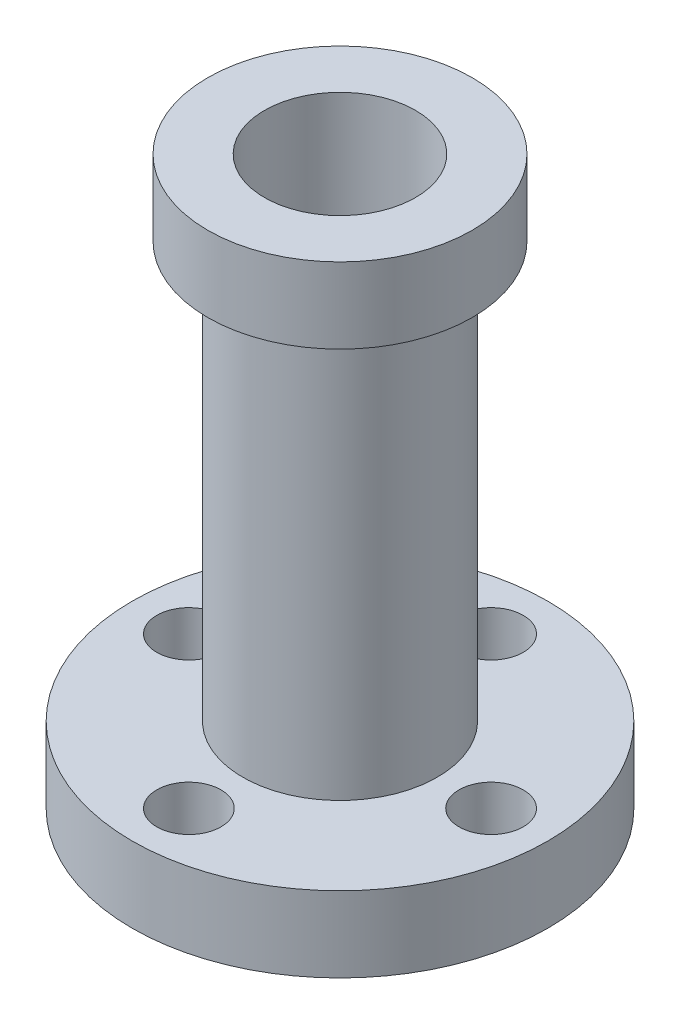
ISO-10303-21;
HEADER;
FILE_DESCRIPTION(('STEP AP214'),'2;1');
FILE_NAME('part.step','',(''),(''),'','','');
FILE_SCHEMA(('AUTOMOTIVE_DESIGN { 1 0 10303 214 1 1 1 1 }'));
ENDSEC;
DATA;
#1=APPLICATION_CONTEXT('core data for automotive mechanical design processes');
#2=APPLICATION_PROTOCOL_DEFINITION('international standard','automotive_design',2000,#1);
#3=PRODUCT_CONTEXT('',#1,'mechanical');
#4=PRODUCT('Part','Part','',(#3));
#5=PRODUCT_RELATED_PRODUCT_CATEGORY('part','',(#4));
#6=PRODUCT_DEFINITION_FORMATION('','',#4);
#7=PRODUCT_DEFINITION_CONTEXT('part definition',#1,'design');
#8=PRODUCT_DEFINITION('design','',#6,#7);
#9=PRODUCT_DEFINITION_SHAPE('','',#8);
#10=(LENGTH_UNIT() NAMED_UNIT(*) SI_UNIT(.MILLI.,.METRE.));
#11=(NAMED_UNIT(*) PLANE_ANGLE_UNIT() SI_UNIT($,.RADIAN.));
#12=(NAMED_UNIT(*) SI_UNIT($,.STERADIAN.) SOLID_ANGLE_UNIT());
#13=UNCERTAINTY_MEASURE_WITH_UNIT(LENGTH_MEASURE(1.E-05),#10,'distance_accuracy_value','');
#14=(GEOMETRIC_REPRESENTATION_CONTEXT(3) GLOBAL_UNCERTAINTY_ASSIGNED_CONTEXT((#13)) GLOBAL_UNIT_ASSIGNED_CONTEXT((#10,
#11,#12)) REPRESENTATION_CONTEXT('',''));
#15=CARTESIAN_POINT('',(0.,0.,0.));
#16=DIRECTION('',(0.,0.,1.));
#17=DIRECTION('',(1.,0.,0.));
#18=AXIS2_PLACEMENT_3D('',#15,#16,#17);
#19=CARTESIAN_POINT('',(0.,0.,0.));
#20=DIRECTION('',(0.,-1.,0.));
#21=DIRECTION('',(0.,0.,-1.));
#22=AXIS2_PLACEMENT_3D('',#19,#20,#21);
#23=CYLINDRICAL_SURFACE('',#22,5.15);
#24=CARTESIAN_POINT('',(0.,26.,0.));
#25=DIRECTION('',(0.,-1.,0.));
#26=DIRECTION('',(0.,0.,-1.));
#27=AXIS2_PLACEMENT_3D('',#24,#25,#26);
#28=CIRCLE('',#27,5.15);
#29=CARTESIAN_POINT('',(0.,26.,-5.15));
#30=VERTEX_POINT('',#29);
#31=EDGE_CURVE('E78',#30,#30,#28,.F.);
#32=ORIENTED_EDGE('',*,*,#31,.F.);
#33=EDGE_LOOP('',(#32));
#34=FACE_BOUND('',#33,.T.);
#35=CARTESIAN_POINT('',(0.,4.,0.));
#36=DIRECTION('',(0.,-1.,0.));
#37=DIRECTION('',(0.,0.,-1.));
#38=AXIS2_PLACEMENT_3D('',#35,#36,#37);
#39=CIRCLE('',#38,5.15);
#40=CARTESIAN_POINT('',(0.,4.,-5.15));
#41=VERTEX_POINT('',#40);
#42=EDGE_CURVE('E17',#41,#41,#39,.T.);
#43=ORIENTED_EDGE('',*,*,#42,.F.);
#44=EDGE_LOOP('',(#43));
#45=FACE_BOUND('',#44,.T.);
#46=ADVANCED_FACE('F14',(#34,#45),#23,.T.);
#47=CARTESIAN_POINT('',(11.,4.,0.));
#48=DIRECTION('',(0.,1.,0.));
#49=DIRECTION('',(0.,0.,1.));
#50=AXIS2_PLACEMENT_3D('',#47,#48,#49);
#51=PLANE('',#50);
#52=CARTESIAN_POINT('',(0.,4.,8.));
#53=DIRECTION('',(0.,-1.,0.));
#54=DIRECTION('',(0.,0.,-1.));
#55=AXIS2_PLACEMENT_3D('',#52,#53,#54);
#56=CIRCLE('',#55,1.69999999999999);
#57=CARTESIAN_POINT('',(0.,4.,6.30000000000001));
#58=VERTEX_POINT('',#57);
#59=EDGE_CURVE('E76',#58,#58,#56,.T.);
#60=ORIENTED_EDGE('',*,*,#59,.T.);
#61=EDGE_LOOP('',(#60));
#62=FACE_BOUND('',#61,.T.);
#63=CARTESIAN_POINT('',(0.,4.,-8.));
#64=DIRECTION('',(0.,-1.,0.));
#65=DIRECTION('',(0.,0.,-1.));
#66=AXIS2_PLACEMENT_3D('',#63,#64,#65);
#67=CIRCLE('',#66,1.69999999999999);
#68=CARTESIAN_POINT('',(0.,4.,-9.69999999999999));
#69=VERTEX_POINT('',#68);
#70=EDGE_CURVE('E68',#69,#69,#67,.T.);
#71=ORIENTED_EDGE('',*,*,#70,.T.);
#72=EDGE_LOOP('',(#71));
#73=FACE_BOUND('',#72,.T.);
#74=CARTESIAN_POINT('',(0.,4.,0.));
#75=DIRECTION('',(0.,-1.,0.));
#76=DIRECTION('',(0.,0.,-1.));
#77=AXIS2_PLACEMENT_3D('',#74,#75,#76);
#78=CIRCLE('',#77,11.);
#79=CARTESIAN_POINT('',(0.,4.,-11.));
#80=VERTEX_POINT('',#79);
#81=EDGE_CURVE('E60',#80,#80,#78,.T.);
#82=ORIENTED_EDGE('',*,*,#81,.F.);
#83=EDGE_LOOP('',(#82));
#84=FACE_BOUND('',#83,.T.);
#85=ORIENTED_EDGE('',*,*,#42,.T.);
#86=EDGE_LOOP('',(#85));
#87=FACE_BOUND('',#86,.T.);
#88=CARTESIAN_POINT('',(-8.,4.,0.));
#89=DIRECTION('',(0.,-1.,0.));
#90=DIRECTION('',(0.,0.,-1.));
#91=AXIS2_PLACEMENT_3D('',#88,#89,#90);
#92=CIRCLE('',#91,1.69999999999999);
#93=CARTESIAN_POINT('',(-8.,4.,-1.69999999999999));
#94=VERTEX_POINT('',#93);
#95=EDGE_CURVE('E64',#94,#94,#92,.T.);
#96=ORIENTED_EDGE('',*,*,#95,.T.);
#97=EDGE_LOOP('',(#96));
#98=FACE_BOUND('',#97,.T.);
#99=CARTESIAN_POINT('',(8.,4.,0.));
#100=DIRECTION('',(0.,-1.,0.));
#101=DIRECTION('',(0.,0.,-1.));
#102=AXIS2_PLACEMENT_3D('',#99,#100,#101);
#103=CIRCLE('',#102,1.69999999999999);
#104=CARTESIAN_POINT('',(8.,4.,-1.69999999999999));
#105=VERTEX_POINT('',#104);
#106=EDGE_CURVE('E72',#105,#105,#103,.T.);
#107=ORIENTED_EDGE('',*,*,#106,.T.);
#108=EDGE_LOOP('',(#107));
#109=FACE_BOUND('',#108,.T.);
#110=ADVANCED_FACE('F87',(#62,#73,#84,#87,#98,#109),#51,.T.);
#111=CARTESIAN_POINT('',(5.15,26.,0.));
#112=DIRECTION('',(0.,-1.,0.));
#113=DIRECTION('',(0.,0.,-1.));
#114=AXIS2_PLACEMENT_3D('',#111,#112,#113);
#115=PLANE('',#114);
#116=ORIENTED_EDGE('',*,*,#31,.T.);
#117=EDGE_LOOP('',(#116));
#118=FACE_BOUND('',#117,.T.);
#119=CARTESIAN_POINT('',(0.,26.,0.));
#120=DIRECTION('',(0.,-1.,0.));
#121=DIRECTION('',(0.,0.,-1.));
#122=AXIS2_PLACEMENT_3D('',#119,#120,#121);
#123=CIRCLE('',#122,7.);
#124=CARTESIAN_POINT('',(0.,26.,-7.));
#125=VERTEX_POINT('',#124);
#126=EDGE_CURVE('E56',#125,#125,#123,.F.);
#127=ORIENTED_EDGE('',*,*,#126,.F.);
#128=EDGE_LOOP('',(#127));
#129=FACE_BOUND('',#128,.T.);
#130=ADVANCED_FACE('F97',(#118,#129),#115,.T.);
#131=CARTESIAN_POINT('',(0.,0.,8.));
#132=DIRECTION('',(0.,-1.,0.));
#133=DIRECTION('',(0.,0.,-1.));
#134=AXIS2_PLACEMENT_3D('',#131,#132,#133);
#135=CYLINDRICAL_SURFACE('',#134,1.69999999999999);
#136=CARTESIAN_POINT('',(0.,0.,8.));
#137=DIRECTION('',(0.,-1.,0.));
#138=DIRECTION('',(0.,0.,-1.));
#139=AXIS2_PLACEMENT_3D('',#136,#137,#138);
#140=CIRCLE('',#139,1.69999999999999);
#141=CARTESIAN_POINT('',(0.,0.,6.30000000000001));
#142=VERTEX_POINT('',#141);
#143=EDGE_CURVE('E52',#142,#142,#140,.F.);
#144=ORIENTED_EDGE('',*,*,#143,.F.);
#145=EDGE_LOOP('',(#144));
#146=FACE_BOUND('',#145,.T.);
#147=ORIENTED_EDGE('',*,*,#59,.F.);
#148=EDGE_LOOP('',(#147));
#149=FACE_BOUND('',#148,.T.);
#150=ADVANCED_FACE('F132',(#146,#149),#135,.F.);
#151=CARTESIAN_POINT('',(8.,0.,0.));
#152=DIRECTION('',(0.,-1.,0.));
#153=DIRECTION('',(0.,0.,-1.));
#154=AXIS2_PLACEMENT_3D('',#151,#152,#153);
#155=CYLINDRICAL_SURFACE('',#154,1.69999999999999);
#156=CARTESIAN_POINT('',(8.,0.,0.));
#157=DIRECTION('',(0.,-1.,0.));
#158=DIRECTION('',(0.,0.,-1.));
#159=AXIS2_PLACEMENT_3D('',#156,#157,#158);
#160=CIRCLE('',#159,1.69999999999999);
#161=CARTESIAN_POINT('',(8.,0.,-1.69999999999999));
#162=VERTEX_POINT('',#161);
#163=EDGE_CURVE('E48',#162,#162,#160,.F.);
#164=ORIENTED_EDGE('',*,*,#163,.F.);
#165=EDGE_LOOP('',(#164));
#166=FACE_BOUND('',#165,.T.);
#167=ORIENTED_EDGE('',*,*,#106,.F.);
#168=EDGE_LOOP('',(#167));
#169=FACE_BOUND('',#168,.T.);
#170=ADVANCED_FACE('F128',(#166,#169),#155,.F.);
#171=CARTESIAN_POINT('',(0.,0.,-8.));
#172=DIRECTION('',(0.,-1.,0.));
#173=DIRECTION('',(0.,0.,-1.));
#174=AXIS2_PLACEMENT_3D('',#171,#172,#173);
#175=CYLINDRICAL_SURFACE('',#174,1.69999999999999);
#176=CARTESIAN_POINT('',(0.,0.,-8.));
#177=DIRECTION('',(0.,-1.,0.));
#178=DIRECTION('',(0.,0.,-1.));
#179=AXIS2_PLACEMENT_3D('',#176,#177,#178);
#180=CIRCLE('',#179,1.69999999999999);
#181=CARTESIAN_POINT('',(0.,0.,-9.69999999999999));
#182=VERTEX_POINT('',#181);
#183=EDGE_CURVE('E44',#182,#182,#180,.F.);
#184=ORIENTED_EDGE('',*,*,#183,.F.);
#185=EDGE_LOOP('',(#184));
#186=FACE_BOUND('',#185,.T.);
#187=ORIENTED_EDGE('',*,*,#70,.F.);
#188=EDGE_LOOP('',(#187));
#189=FACE_BOUND('',#188,.T.);
#190=ADVANCED_FACE('F124',(#186,#189),#175,.F.);
#191=CARTESIAN_POINT('',(-8.,0.,0.));
#192=DIRECTION('',(0.,-1.,0.));
#193=DIRECTION('',(0.,0.,-1.));
#194=AXIS2_PLACEMENT_3D('',#191,#192,#193);
#195=CYLINDRICAL_SURFACE('',#194,1.69999999999999);
#196=CARTESIAN_POINT('',(-8.,0.,0.));
#197=DIRECTION('',(0.,-1.,0.));
#198=DIRECTION('',(0.,0.,-1.));
#199=AXIS2_PLACEMENT_3D('',#196,#197,#198);
#200=CIRCLE('',#199,1.69999999999999);
#201=CARTESIAN_POINT('',(-8.,0.,-1.69999999999999));
#202=VERTEX_POINT('',#201);
#203=EDGE_CURVE('E40',#202,#202,#200,.F.);
#204=ORIENTED_EDGE('',*,*,#203,.F.);
#205=EDGE_LOOP('',(#204));
#206=FACE_BOUND('',#205,.T.);
#207=ORIENTED_EDGE('',*,*,#95,.F.);
#208=EDGE_LOOP('',(#207));
#209=FACE_BOUND('',#208,.T.);
#210=ADVANCED_FACE('F121',(#206,#209),#195,.F.);
#211=CARTESIAN_POINT('',(0.,0.,0.));
#212=DIRECTION('',(0.,-1.,0.));
#213=DIRECTION('',(0.,0.,-1.));
#214=AXIS2_PLACEMENT_3D('',#211,#212,#213);
#215=CYLINDRICAL_SURFACE('',#214,11.);
#216=ORIENTED_EDGE('',*,*,#81,.T.);
#217=EDGE_LOOP('',(#216));
#218=FACE_BOUND('',#217,.T.);
#219=CARTESIAN_POINT('',(0.,0.,0.));
#220=DIRECTION('',(0.,-1.,0.));
#221=DIRECTION('',(0.,0.,-1.));
#222=AXIS2_PLACEMENT_3D('',#219,#220,#221);
#223=CIRCLE('',#222,11.);
#224=CARTESIAN_POINT('',(0.,0.,-11.));
#225=VERTEX_POINT('',#224);
#226=EDGE_CURVE('E36',#225,#225,#223,.T.);
#227=ORIENTED_EDGE('',*,*,#226,.F.);
#228=EDGE_LOOP('',(#227));
#229=FACE_BOUND('',#228,.T.);
#230=ADVANCED_FACE('F117',(#218,#229),#215,.T.);
#231=CARTESIAN_POINT('',(0.,0.,0.));
#232=DIRECTION('',(0.,-1.,0.));
#233=DIRECTION('',(0.,0.,-1.));
#234=AXIS2_PLACEMENT_3D('',#231,#232,#233);
#235=CYLINDRICAL_SURFACE('',#234,7.);
#236=CARTESIAN_POINT('',(0.,30.,0.));
#237=DIRECTION('',(0.,-1.,0.));
#238=DIRECTION('',(0.,0.,-1.));
#239=AXIS2_PLACEMENT_3D('',#236,#237,#238);
#240=CIRCLE('',#239,7.);
#241=CARTESIAN_POINT('',(0.,30.,-7.));
#242=VERTEX_POINT('',#241);
#243=EDGE_CURVE('E30',#242,#242,#240,.F.);
#244=ORIENTED_EDGE('',*,*,#243,.F.);
#245=EDGE_LOOP('',(#244));
#246=FACE_BOUND('',#245,.T.);
#247=ORIENTED_EDGE('',*,*,#126,.T.);
#248=EDGE_LOOP('',(#247));
#249=FACE_BOUND('',#248,.T.);
#250=ADVANCED_FACE('F113',(#246,#249),#235,.T.);
#251=CARTESIAN_POINT('',(4.,0.,0.));
#252=DIRECTION('',(0.,-1.,0.));
#253=DIRECTION('',(0.,0.,-1.));
#254=AXIS2_PLACEMENT_3D('',#251,#252,#253);
#255=PLANE('',#254);
#256=CARTESIAN_POINT('',(0.,0.,0.));
#257=DIRECTION('',(0.,-1.,0.));
#258=DIRECTION('',(0.,0.,-1.));
#259=AXIS2_PLACEMENT_3D('',#256,#257,#258);
#260=CIRCLE('',#259,4.);
#261=CARTESIAN_POINT('',(0.,0.,-4.));
#262=VERTEX_POINT('',#261);
#263=EDGE_CURVE('E22',#262,#262,#260,.F.);
#264=ORIENTED_EDGE('',*,*,#263,.T.);
#265=EDGE_LOOP('',(#264));
#266=FACE_BOUND('',#265,.T.);
#267=ORIENTED_EDGE('',*,*,#226,.T.);
#268=EDGE_LOOP('',(#267));
#269=FACE_BOUND('',#268,.T.);
#270=ORIENTED_EDGE('',*,*,#203,.T.);
#271=EDGE_LOOP('',(#270));
#272=FACE_BOUND('',#271,.T.);
#273=ORIENTED_EDGE('',*,*,#183,.T.);
#274=EDGE_LOOP('',(#273));
#275=FACE_BOUND('',#274,.T.);
#276=ORIENTED_EDGE('',*,*,#163,.T.);
#277=EDGE_LOOP('',(#276));
#278=FACE_BOUND('',#277,.T.);
#279=ORIENTED_EDGE('',*,*,#143,.T.);
#280=EDGE_LOOP('',(#279));
#281=FACE_BOUND('',#280,.T.);
#282=ADVANCED_FACE('F105',(#266,#269,#272,#275,#278,#281),#255,.T.);
#283=CARTESIAN_POINT('',(7.,30.,0.));
#284=DIRECTION('',(0.,1.,0.));
#285=DIRECTION('',(0.,0.,1.));
#286=AXIS2_PLACEMENT_3D('',#283,#284,#285);
#287=PLANE('',#286);
#288=ORIENTED_EDGE('',*,*,#243,.T.);
#289=EDGE_LOOP('',(#288));
#290=FACE_BOUND('',#289,.T.);
#291=CARTESIAN_POINT('',(0.,30.,0.));
#292=DIRECTION('',(0.,-1.,0.));
#293=DIRECTION('',(0.,0.,-1.));
#294=AXIS2_PLACEMENT_3D('',#291,#292,#293);
#295=CIRCLE('',#294,4.);
#296=CARTESIAN_POINT('',(0.,30.,-4.));
#297=VERTEX_POINT('',#296);
#298=EDGE_CURVE('E10',#297,#297,#295,.T.);
#299=ORIENTED_EDGE('',*,*,#298,.T.);
#300=EDGE_LOOP('',(#299));
#301=FACE_BOUND('',#300,.T.);
#302=ADVANCED_FACE('F100',(#290,#301),#287,.T.);
#303=CARTESIAN_POINT('',(0.,0.,0.));
#304=DIRECTION('',(0.,-1.,0.));
#305=DIRECTION('',(0.,0.,-1.));
#306=AXIS2_PLACEMENT_3D('',#303,#304,#305);
#307=CYLINDRICAL_SURFACE('',#306,4.);
#308=ORIENTED_EDGE('',*,*,#263,.F.);
#309=EDGE_LOOP('',(#308));
#310=FACE_BOUND('',#309,.T.);
#311=ORIENTED_EDGE('',*,*,#298,.F.);
#312=EDGE_LOOP('',(#311));
#313=FACE_BOUND('',#312,.T.);
#314=ADVANCED_FACE('F99',(#310,#313),#307,.F.);
#315=CLOSED_SHELL('',(#46,#110,#130,#150,#170,#190,#210,#230,#250,#282,#302,#314));
#316=MANIFOLD_SOLID_BREP('B1',#315);
#317=ADVANCED_BREP_SHAPE_REPRESENTATION('',(#18,#316),#14);
#318=SHAPE_DEFINITION_REPRESENTATION(#9,#317);
ENDSEC;
END-ISO-10303-21;
